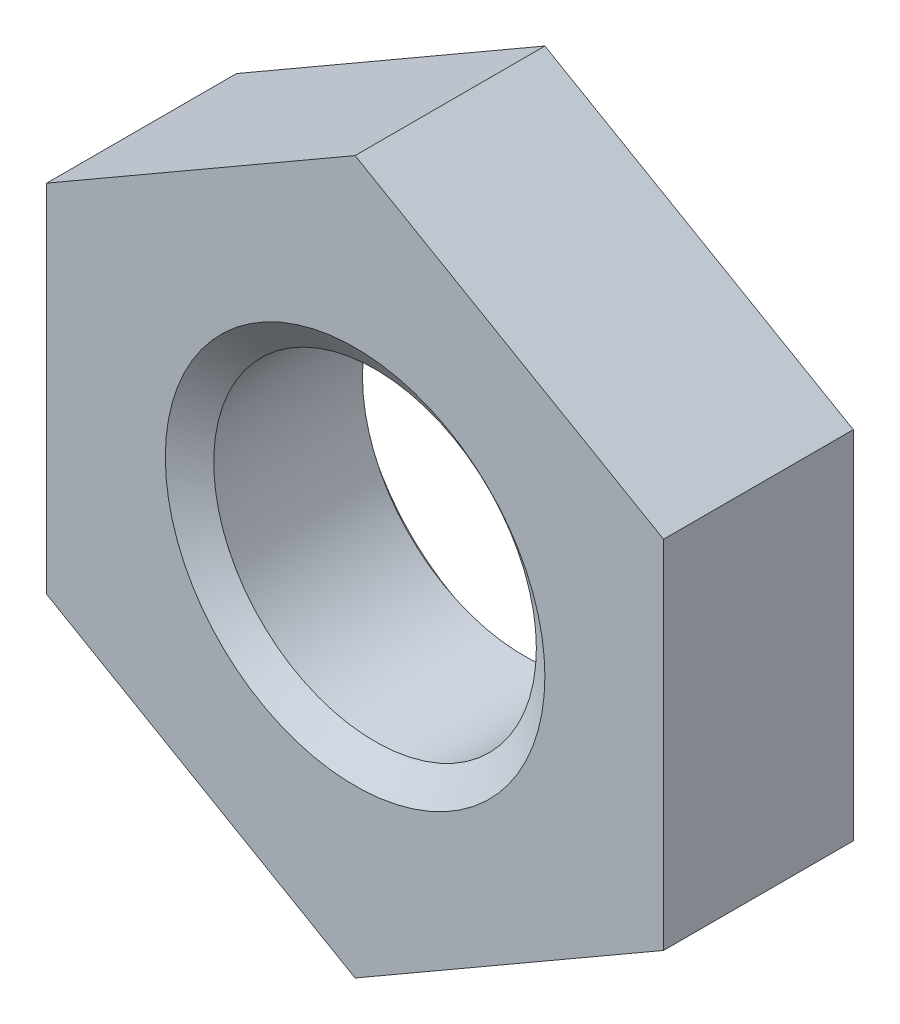
ISO-10303-21;
HEADER;
FILE_DESCRIPTION(('STEP AP214'),'2;1');
FILE_NAME('part.step','',(''),(''),'','','');
FILE_SCHEMA(('AUTOMOTIVE_DESIGN { 1 0 10303 214 1 1 1 1 }'));
ENDSEC;
DATA;
#1=APPLICATION_CONTEXT('core data for automotive mechanical design processes');
#2=APPLICATION_PROTOCOL_DEFINITION('international standard','automotive_design',2000,#1);
#3=PRODUCT_CONTEXT('',#1,'mechanical');
#4=PRODUCT('Part','Part','',(#3));
#5=PRODUCT_RELATED_PRODUCT_CATEGORY('part','',(#4));
#6=PRODUCT_DEFINITION_FORMATION('','',#4);
#7=PRODUCT_DEFINITION_CONTEXT('part definition',#1,'design');
#8=PRODUCT_DEFINITION('design','',#6,#7);
#9=PRODUCT_DEFINITION_SHAPE('','',#8);
#10=(LENGTH_UNIT() NAMED_UNIT(*) SI_UNIT(.MILLI.,.METRE.));
#11=(NAMED_UNIT(*) PLANE_ANGLE_UNIT() SI_UNIT($,.RADIAN.));
#12=(NAMED_UNIT(*) SI_UNIT($,.STERADIAN.) SOLID_ANGLE_UNIT());
#13=UNCERTAINTY_MEASURE_WITH_UNIT(LENGTH_MEASURE(1.E-05),#10,'distance_accuracy_value','');
#14=(GEOMETRIC_REPRESENTATION_CONTEXT(3) GLOBAL_UNCERTAINTY_ASSIGNED_CONTEXT((#13)) GLOBAL_UNIT_ASSIGNED_CONTEXT((#10,
#11,#12)) REPRESENTATION_CONTEXT('',''));
#15=CARTESIAN_POINT('',(0.,0.,0.));
#16=DIRECTION('',(0.,0.,1.));
#17=DIRECTION('',(1.,0.,0.));
#18=AXIS2_PLACEMENT_3D('',#15,#16,#17);
#19=CARTESIAN_POINT('',(0.,0.,-4.));
#20=DIRECTION('',(0.,0.,1.));
#21=DIRECTION('',(1.,0.,0.));
#22=AXIS2_PLACEMENT_3D('',#19,#20,#21);
#23=CYLINDRICAL_SURFACE('',#22,3.4);
#24=CARTESIAN_POINT('',(0.,0.,-0.420124522925829));
#25=DIRECTION('',(0.,0.,1.));
#26=DIRECTION('',(1.,0.,0.));
#27=AXIS2_PLACEMENT_3D('',#24,#25,#26);
#28=CIRCLE('',#27,3.4);
#29=CARTESIAN_POINT('',(3.4,0.,-0.420124522925829));
#30=VERTEX_POINT('',#29);
#31=EDGE_CURVE('E131',#30,#30,#28,.F.);
#32=ORIENTED_EDGE('',*,*,#31,.F.);
#33=EDGE_LOOP('',(#32));
#34=FACE_BOUND('',#33,.T.);
#35=CARTESIAN_POINT('',(0.,0.,-3.55447547707417));
#36=DIRECTION('',(0.,0.,-1.));
#37=DIRECTION('',(-1.,0.,0.));
#38=AXIS2_PLACEMENT_3D('',#35,#36,#37);
#39=CIRCLE('',#38,3.4);
#40=CARTESIAN_POINT('',(-3.4,0.,-3.55447547707417));
#41=VERTEX_POINT('',#40);
#42=EDGE_CURVE('E44',#41,#41,#39,.F.);
#43=ORIENTED_EDGE('',*,*,#42,.F.);
#44=EDGE_LOOP('',(#43));
#45=FACE_BOUND('',#44,.T.);
#46=ADVANCED_FACE('F40',(#34,#45),#23,.F.);
#47=CARTESIAN_POINT('',(0.,7.50555349946514,-4.));
#48=DIRECTION('',(-0.500000000000001,0.866025403784438,0.));
#49=DIRECTION('',(-0.866025403784438,-0.500000000000001,0.));
#50=AXIS2_PLACEMENT_3D('',#47,#48,#49);
#51=PLANE('',#50);
#52=DIRECTION('',(-0.866025403784438,-0.500000000000001,0.));
#53=VECTOR('',#52,1.);
#54=CARTESIAN_POINT('',(0.,7.50555349946514,0.));
#55=LINE('',#54,#53);
#56=CARTESIAN_POINT('',(0.,7.50555349946514,0.));
#57=VERTEX_POINT('',#56);
#58=CARTESIAN_POINT('',(-6.5,3.75277674973257,0.));
#59=VERTEX_POINT('',#58);
#60=EDGE_CURVE('E127',#57,#59,#55,.T.);
#61=ORIENTED_EDGE('',*,*,#60,.F.);
#62=DIRECTION('',(0.,0.,1.));
#63=VECTOR('',#62,1.);
#64=CARTESIAN_POINT('',(0.,7.50555349946514,-4.));
#65=LINE('',#64,#63);
#66=CARTESIAN_POINT('',(0.,7.50555349946514,-4.));
#67=VERTEX_POINT('',#66);
#68=EDGE_CURVE('E11',#67,#57,#65,.T.);
#69=ORIENTED_EDGE('',*,*,#68,.F.);
#70=DIRECTION('',(-0.866025403784438,-0.500000000000001,0.));
#71=VECTOR('',#70,1.);
#72=CARTESIAN_POINT('',(0.,7.50555349946514,-4.));
#73=LINE('',#72,#71);
#74=CARTESIAN_POINT('',(-6.5,3.75277674973257,-4.));
#75=VERTEX_POINT('',#74);
#76=EDGE_CURVE('E142',#67,#75,#73,.T.);
#77=ORIENTED_EDGE('',*,*,#76,.T.);
#78=DIRECTION('',(0.,0.,1.));
#79=VECTOR('',#78,1.);
#80=CARTESIAN_POINT('',(-6.5,3.75277674973257,-4.));
#81=LINE('',#80,#79);
#82=EDGE_CURVE('E91',#75,#59,#81,.T.);
#83=ORIENTED_EDGE('',*,*,#82,.T.);
#84=EDGE_LOOP('',(#61,#69,#77,#83));
#85=FACE_BOUND('',#84,.T.);
#86=ADVANCED_FACE('F42',(#85),#51,.T.);
#87=CARTESIAN_POINT('',(6.5,3.75277674973256,-4.));
#88=DIRECTION('',(0.500000000000001,0.866025403784438,0.));
#89=DIRECTION('',(-0.866025403784438,0.500000000000001,0.));
#90=AXIS2_PLACEMENT_3D('',#87,#88,#89);
#91=PLANE('',#90);
#92=DIRECTION('',(-0.866025403784438,0.500000000000001,0.));
#93=VECTOR('',#92,1.);
#94=CARTESIAN_POINT('',(6.5,3.75277674973256,0.));
#95=LINE('',#94,#93);
#96=CARTESIAN_POINT('',(6.5,3.75277674973256,0.));
#97=VERTEX_POINT('',#96);
#98=EDGE_CURVE('E140',#97,#57,#95,.T.);
#99=ORIENTED_EDGE('',*,*,#98,.F.);
#100=DIRECTION('',(0.,0.,1.));
#101=VECTOR('',#100,1.);
#102=CARTESIAN_POINT('',(6.5,3.75277674973256,-4.));
#103=LINE('',#102,#101);
#104=CARTESIAN_POINT('',(6.5,3.75277674973256,-4.));
#105=VERTEX_POINT('',#104);
#106=EDGE_CURVE('E50',#105,#97,#103,.T.);
#107=ORIENTED_EDGE('',*,*,#106,.F.);
#108=DIRECTION('',(-0.866025403784438,0.500000000000001,0.));
#109=VECTOR('',#108,1.);
#110=CARTESIAN_POINT('',(6.5,3.75277674973256,-4.));
#111=LINE('',#110,#109);
#112=EDGE_CURVE('E109',#105,#67,#111,.T.);
#113=ORIENTED_EDGE('',*,*,#112,.T.);
#114=ORIENTED_EDGE('',*,*,#68,.T.);
#115=EDGE_LOOP('',(#99,#107,#113,#114));
#116=FACE_BOUND('',#115,.T.);
#117=ADVANCED_FACE('F168',(#116),#91,.T.);
#118=CARTESIAN_POINT('',(6.5,3.75277674973256,-4.));
#119=DIRECTION('',(-1.,0.,0.));
#120=DIRECTION('',(0.,0.,1.));
#121=AXIS2_PLACEMENT_3D('',#118,#119,#120);
#122=PLANE('',#121);
#123=DIRECTION('',(0.,-1.,0.));
#124=VECTOR('',#123,1.);
#125=CARTESIAN_POINT('',(6.5,3.75277674973256,0.));
#126=LINE('',#125,#124);
#127=CARTESIAN_POINT('',(6.5,-3.75277674973257,0.));
#128=VERTEX_POINT('',#127);
#129=EDGE_CURVE('E113',#97,#128,#126,.T.);
#130=ORIENTED_EDGE('',*,*,#129,.T.);
#131=DIRECTION('',(0.,0.,1.));
#132=VECTOR('',#131,1.);
#133=CARTESIAN_POINT('',(6.5,-3.75277674973257,-4.));
#134=LINE('',#133,#132);
#135=CARTESIAN_POINT('',(6.5,-3.75277674973257,-4.));
#136=VERTEX_POINT('',#135);
#137=EDGE_CURVE('E111',#136,#128,#134,.T.);
#138=ORIENTED_EDGE('',*,*,#137,.F.);
#139=DIRECTION('',(0.,-1.,0.));
#140=VECTOR('',#139,1.);
#141=CARTESIAN_POINT('',(6.5,3.75277674973256,-4.));
#142=LINE('',#141,#140);
#143=EDGE_CURVE('E102',#105,#136,#142,.T.);
#144=ORIENTED_EDGE('',*,*,#143,.F.);
#145=ORIENTED_EDGE('',*,*,#106,.T.);
#146=EDGE_LOOP('',(#130,#138,#144,#145));
#147=FACE_BOUND('',#146,.T.);
#148=ADVANCED_FACE('F112',(#147),#122,.F.);
#149=CARTESIAN_POINT('',(0.,-7.50555349946515,-4.));
#150=DIRECTION('',(0.5,-0.866025403784438,0.));
#151=DIRECTION('',(0.866025403784438,0.5,0.));
#152=AXIS2_PLACEMENT_3D('',#149,#150,#151);
#153=PLANE('',#152);
#154=DIRECTION('',(0.866025403784438,0.5,0.));
#155=VECTOR('',#154,1.);
#156=CARTESIAN_POINT('',(0.,-7.50555349946515,0.));
#157=LINE('',#156,#155);
#158=CARTESIAN_POINT('',(0.,-7.50555349946515,0.));
#159=VERTEX_POINT('',#158);
#160=EDGE_CURVE('E137',#159,#128,#157,.T.);
#161=ORIENTED_EDGE('',*,*,#160,.F.);
#162=DIRECTION('',(0.,0.,1.));
#163=VECTOR('',#162,1.);
#164=CARTESIAN_POINT('',(0.,-7.50555349946515,-4.));
#165=LINE('',#164,#163);
#166=CARTESIAN_POINT('',(0.,-7.50555349946515,-4.));
#167=VERTEX_POINT('',#166);
#168=EDGE_CURVE('E117',#167,#159,#165,.T.);
#169=ORIENTED_EDGE('',*,*,#168,.F.);
#170=DIRECTION('',(0.866025403784438,0.5,0.));
#171=VECTOR('',#170,1.);
#172=CARTESIAN_POINT('',(0.,-7.50555349946515,-4.));
#173=LINE('',#172,#171);
#174=EDGE_CURVE('E107',#167,#136,#173,.T.);
#175=ORIENTED_EDGE('',*,*,#174,.T.);
#176=ORIENTED_EDGE('',*,*,#137,.T.);
#177=EDGE_LOOP('',(#161,#169,#175,#176));
#178=FACE_BOUND('',#177,.T.);
#179=ADVANCED_FACE('F119',(#178),#153,.T.);
#180=CARTESIAN_POINT('',(-6.5,-3.75277674973257,-4.));
#181=DIRECTION('',(-0.500000000000001,-0.866025403784438,0.));
#182=DIRECTION('',(0.866025403784438,-0.500000000000001,0.));
#183=AXIS2_PLACEMENT_3D('',#180,#181,#182);
#184=PLANE('',#183);
#185=DIRECTION('',(0.866025403784438,-0.500000000000001,0.));
#186=VECTOR('',#185,1.);
#187=CARTESIAN_POINT('',(-6.5,-3.75277674973257,0.));
#188=LINE('',#187,#186);
#189=CARTESIAN_POINT('',(-6.5,-3.75277674973257,0.));
#190=VERTEX_POINT('',#189);
#191=EDGE_CURVE('E134',#190,#159,#188,.T.);
#192=ORIENTED_EDGE('',*,*,#191,.F.);
#193=DIRECTION('',(0.,0.,1.));
#194=VECTOR('',#193,1.);
#195=CARTESIAN_POINT('',(-6.5,-3.75277674973257,-4.));
#196=LINE('',#195,#194);
#197=CARTESIAN_POINT('',(-6.5,-3.75277674973257,-4.));
#198=VERTEX_POINT('',#197);
#199=EDGE_CURVE('E146',#198,#190,#196,.T.);
#200=ORIENTED_EDGE('',*,*,#199,.F.);
#201=DIRECTION('',(0.866025403784438,-0.500000000000001,0.));
#202=VECTOR('',#201,1.);
#203=CARTESIAN_POINT('',(-6.5,-3.75277674973257,-4.));
#204=LINE('',#203,#202);
#205=EDGE_CURVE('E120',#198,#167,#204,.T.);
#206=ORIENTED_EDGE('',*,*,#205,.T.);
#207=ORIENTED_EDGE('',*,*,#168,.T.);
#208=EDGE_LOOP('',(#192,#200,#206,#207));
#209=FACE_BOUND('',#208,.T.);
#210=ADVANCED_FACE('F240',(#209),#184,.T.);
#211=CARTESIAN_POINT('',(-6.5,3.75277674973257,-4.));
#212=DIRECTION('',(-1.,0.,0.));
#213=DIRECTION('',(0.,0.,1.));
#214=AXIS2_PLACEMENT_3D('',#211,#212,#213);
#215=PLANE('',#214);
#216=DIRECTION('',(0.,-1.,0.));
#217=VECTOR('',#216,1.);
#218=CARTESIAN_POINT('',(-6.5,3.75277674973257,0.));
#219=LINE('',#218,#217);
#220=EDGE_CURVE('E130',#59,#190,#219,.T.);
#221=ORIENTED_EDGE('',*,*,#220,.F.);
#222=ORIENTED_EDGE('',*,*,#82,.F.);
#223=DIRECTION('',(0.,-1.,0.));
#224=VECTOR('',#223,1.);
#225=CARTESIAN_POINT('',(-6.5,3.75277674973257,-4.));
#226=LINE('',#225,#224);
#227=EDGE_CURVE('E122',#75,#198,#226,.T.);
#228=ORIENTED_EDGE('',*,*,#227,.T.);
#229=ORIENTED_EDGE('',*,*,#199,.T.);
#230=EDGE_LOOP('',(#221,#222,#228,#229));
#231=FACE_BOUND('',#230,.T.);
#232=ADVANCED_FACE('F164',(#231),#215,.T.);
#233=CARTESIAN_POINT('',(0.,7.50555349946514,-4.));
#234=DIRECTION('',(0.,0.,-1.));
#235=DIRECTION('',(-1.,0.,0.));
#236=AXIS2_PLACEMENT_3D('',#233,#234,#235);
#237=PLANE('',#236);
#238=CARTESIAN_POINT('',(0.,0.,-4.));
#239=DIRECTION('',(0.,0.,-1.));
#240=DIRECTION('',(-1.,0.,0.));
#241=AXIS2_PLACEMENT_3D('',#238,#239,#240);
#242=CIRCLE('',#241,4.);
#243=CARTESIAN_POINT('',(-4.,0.,-4.));
#244=VERTEX_POINT('',#243);
#245=EDGE_CURVE('E151',#244,#244,#242,.F.);
#246=ORIENTED_EDGE('',*,*,#245,.T.);
#247=EDGE_LOOP('',(#246));
#248=FACE_BOUND('',#247,.T.);
#249=ORIENTED_EDGE('',*,*,#76,.F.);
#250=ORIENTED_EDGE('',*,*,#112,.F.);
#251=ORIENTED_EDGE('',*,*,#143,.T.);
#252=ORIENTED_EDGE('',*,*,#174,.F.);
#253=ORIENTED_EDGE('',*,*,#205,.F.);
#254=ORIENTED_EDGE('',*,*,#227,.F.);
#255=EDGE_LOOP('',(#249,#250,#251,#252,#253,#254));
#256=FACE_BOUND('',#255,.T.);
#257=ADVANCED_FACE('F104',(#248,#256),#237,.T.);
#258=CARTESIAN_POINT('',(0.,7.50555349946514,0.));
#259=DIRECTION('',(0.,0.,-1.));
#260=DIRECTION('',(-1.,0.,0.));
#261=AXIS2_PLACEMENT_3D('',#258,#259,#260);
#262=PLANE('',#261);
#263=CARTESIAN_POINT('',(0.,0.,0.));
#264=DIRECTION('',(0.,0.,1.));
#265=DIRECTION('',(1.,0.,0.));
#266=AXIS2_PLACEMENT_3D('',#263,#264,#265);
#267=CIRCLE('',#266,4.);
#268=CARTESIAN_POINT('',(4.,0.,0.));
#269=VERTEX_POINT('',#268);
#270=EDGE_CURVE('E150',#269,#269,#267,.T.);
#271=ORIENTED_EDGE('',*,*,#270,.F.);
#272=EDGE_LOOP('',(#271));
#273=FACE_BOUND('',#272,.T.);
#274=ORIENTED_EDGE('',*,*,#60,.T.);
#275=ORIENTED_EDGE('',*,*,#220,.T.);
#276=ORIENTED_EDGE('',*,*,#191,.T.);
#277=ORIENTED_EDGE('',*,*,#160,.T.);
#278=ORIENTED_EDGE('',*,*,#129,.F.);
#279=ORIENTED_EDGE('',*,*,#98,.T.);
#280=EDGE_LOOP('',(#274,#275,#276,#277,#278,#279));
#281=FACE_BOUND('',#280,.T.);
#282=ADVANCED_FACE('F167',(#273,#281),#262,.F.);
#283=CARTESIAN_POINT('',(0.,0.,-0.462136975218411));
#284=DIRECTION('',(0.,0.,1.));
#285=DIRECTION('',(1.,0.,0.));
#286=AXIS2_PLACEMENT_3D('',#283,#284,#285);
#287=CONICAL_SURFACE('',#286,3.34,0.959931088596878);
#288=ORIENTED_EDGE('',*,*,#270,.T.);
#289=EDGE_LOOP('',(#288));
#290=FACE_BOUND('',#289,.T.);
#291=ORIENTED_EDGE('',*,*,#31,.T.);
#292=EDGE_LOOP('',(#291));
#293=FACE_BOUND('',#292,.T.);
#294=ADVANCED_FACE('F186',(#290,#293),#287,.F.);
#295=CARTESIAN_POINT('',(0.,0.,-3.9746));
#296=DIRECTION('',(0.,0.,-1.));
#297=DIRECTION('',(-1.,0.,0.));
#298=AXIS2_PLACEMENT_3D('',#295,#296,#297);
#299=CONICAL_SURFACE('',#298,4.,0.959931088596882);
#300=CARTESIAN_POINT('',(0.,0.,-3.9746));
#301=DIRECTION('',(0.,0.,1.));
#302=DIRECTION('',(1.,0.,0.));
#303=AXIS2_PLACEMENT_3D('',#300,#301,#302);
#304=CIRCLE('',#303,4.);
#305=CARTESIAN_POINT('',(4.,0.,-3.9746));
#306=VERTEX_POINT('',#305);
#307=EDGE_CURVE('E153',#306,#306,#304,.T.);
#308=ORIENTED_EDGE('',*,*,#307,.F.);
#309=EDGE_LOOP('',(#308));
#310=FACE_BOUND('',#309,.T.);
#311=ORIENTED_EDGE('',*,*,#42,.T.);
#312=EDGE_LOOP('',(#311));
#313=FACE_BOUND('',#312,.T.);
#314=ADVANCED_FACE('F194',(#310,#313),#299,.F.);
#315=CARTESIAN_POINT('',(0.,0.,-25.0375057290932));
#316=DIRECTION('',(0.,0.,1.));
#317=DIRECTION('',(1.,0.,0.));
#318=AXIS2_PLACEMENT_3D('',#315,#316,#317);
#319=CYLINDRICAL_SURFACE('',#318,4.);
#320=ORIENTED_EDGE('',*,*,#245,.F.);
#321=EDGE_LOOP('',(#320));
#322=FACE_BOUND('',#321,.T.);
#323=ORIENTED_EDGE('',*,*,#307,.T.);
#324=EDGE_LOOP('',(#323));
#325=FACE_BOUND('',#324,.T.);
#326=ADVANCED_FACE('F201',(#322,#325),#319,.F.);
#327=CLOSED_SHELL('',(#46,#86,#117,#148,#179,#210,#232,#257,#282,#294,#314,#326));
#328=MANIFOLD_SOLID_BREP('B2',#327);
#329=ADVANCED_BREP_SHAPE_REPRESENTATION('',(#18,#328),#14);
#330=SHAPE_DEFINITION_REPRESENTATION(#9,#329);
ENDSEC;
END-ISO-10303-21;
